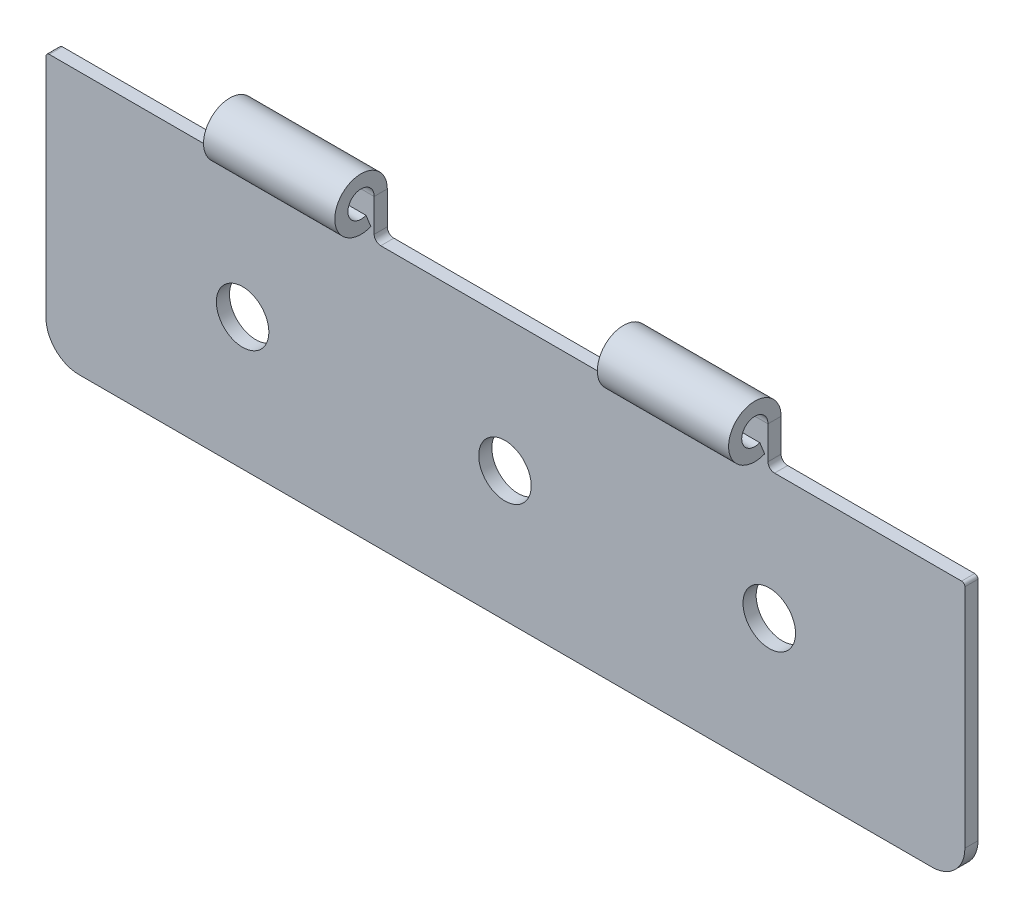
ISO-10303-21;
HEADER;
FILE_DESCRIPTION(('STEP AP214'),'2;1');
FILE_NAME('part.step','',(''),(''),'','','');
FILE_SCHEMA(('AUTOMOTIVE_DESIGN { 1 0 10303 214 1 1 1 1 }'));
ENDSEC;
DATA;
#1=APPLICATION_CONTEXT('core data for automotive mechanical design processes');
#2=APPLICATION_PROTOCOL_DEFINITION('international standard','automotive_design',2000,#1);
#3=PRODUCT_CONTEXT('',#1,'mechanical');
#4=PRODUCT('Part','Part','',(#3));
#5=PRODUCT_RELATED_PRODUCT_CATEGORY('part','',(#4));
#6=PRODUCT_DEFINITION_FORMATION('','',#4);
#7=PRODUCT_DEFINITION_CONTEXT('part definition',#1,'design');
#8=PRODUCT_DEFINITION('design','',#6,#7);
#9=PRODUCT_DEFINITION_SHAPE('','',#8);
#10=(LENGTH_UNIT() NAMED_UNIT(*) SI_UNIT(.MILLI.,.METRE.));
#11=(NAMED_UNIT(*) PLANE_ANGLE_UNIT() SI_UNIT($,.RADIAN.));
#12=(NAMED_UNIT(*) SI_UNIT($,.STERADIAN.) SOLID_ANGLE_UNIT());
#13=UNCERTAINTY_MEASURE_WITH_UNIT(LENGTH_MEASURE(1.E-05),#10,'distance_accuracy_value','');
#14=(GEOMETRIC_REPRESENTATION_CONTEXT(3) GLOBAL_UNCERTAINTY_ASSIGNED_CONTEXT((#13)) GLOBAL_UNIT_ASSIGNED_CONTEXT((#10,
#11,#12)) REPRESENTATION_CONTEXT('',''));
#15=CARTESIAN_POINT('',(0.,0.,0.));
#16=DIRECTION('',(0.,0.,1.));
#17=DIRECTION('',(1.,0.,0.));
#18=AXIS2_PLACEMENT_3D('',#15,#16,#17);
#19=CARTESIAN_POINT('',(90.,40.,-2.));
#20=DIRECTION('',(-1.,0.,0.));
#21=DIRECTION('',(0.,0.,1.));
#22=AXIS2_PLACEMENT_3D('',#19,#20,#21);
#23=PLANE('',#22);
#24=DIRECTION('',(0.,-1.,0.));
#25=VECTOR('',#24,1.);
#26=CARTESIAN_POINT('',(90.,40.,-2.));
#27=LINE('',#26,#25);
#28=CARTESIAN_POINT('',(90.,46.,-2.));
#29=VERTEX_POINT('',#28);
#30=CARTESIAN_POINT('',(90.,41.,-2.));
#31=VERTEX_POINT('',#30);
#32=EDGE_CURVE('E261',#29,#31,#27,.T.);
#33=ORIENTED_EDGE('',*,*,#32,.T.);
#34=DIRECTION('',(0.,0.,1.));
#35=VECTOR('',#34,1.);
#36=CARTESIAN_POINT('',(90.,41.,0.));
#37=LINE('',#36,#35);
#38=CARTESIAN_POINT('',(90.,41.,0.));
#39=VERTEX_POINT('',#38);
#40=EDGE_CURVE('E395',#31,#39,#37,.T.);
#41=ORIENTED_EDGE('',*,*,#40,.T.);
#42=DIRECTION('',(0.,-1.,0.));
#43=VECTOR('',#42,1.);
#44=CARTESIAN_POINT('',(90.,40.,0.));
#45=LINE('',#44,#43);
#46=CARTESIAN_POINT('',(90.,46.,0.));
#47=VERTEX_POINT('',#46);
#48=EDGE_CURVE('E376',#47,#39,#45,.T.);
#49=ORIENTED_EDGE('',*,*,#48,.F.);
#50=DIRECTION('',(0.,0.,-1.));
#51=VECTOR('',#50,1.);
#52=CARTESIAN_POINT('',(90.,46.,0.));
#53=LINE('',#52,#51);
#54=EDGE_CURVE('E273',#47,#29,#53,.T.);
#55=ORIENTED_EDGE('',*,*,#54,.T.);
#56=EDGE_LOOP('',(#33,#41,#49,#55));
#57=FACE_BOUND('',#56,.T.);
#58=ADVANCED_FACE('F42',(#57),#23,.T.);
#59=CARTESIAN_POINT('',(30.,40.,-2.));
#60=DIRECTION('',(-1.,0.,0.));
#61=DIRECTION('',(0.,0.,1.));
#62=AXIS2_PLACEMENT_3D('',#59,#60,#61);
#63=PLANE('',#62);
#64=DIRECTION('',(0.,-1.,0.));
#65=VECTOR('',#64,1.);
#66=CARTESIAN_POINT('',(30.,40.,-2.));
#67=LINE('',#66,#65);
#68=CARTESIAN_POINT('',(30.,46.,-2.));
#69=VERTEX_POINT('',#68);
#70=CARTESIAN_POINT('',(30.,41.,-2.));
#71=VERTEX_POINT('',#70);
#72=EDGE_CURVE('E358',#69,#71,#67,.T.);
#73=ORIENTED_EDGE('',*,*,#72,.T.);
#74=DIRECTION('',(0.,0.,1.));
#75=VECTOR('',#74,1.);
#76=CARTESIAN_POINT('',(30.,41.,0.));
#77=LINE('',#76,#75);
#78=CARTESIAN_POINT('',(30.,41.,0.));
#79=VERTEX_POINT('',#78);
#80=EDGE_CURVE('E366',#71,#79,#77,.T.);
#81=ORIENTED_EDGE('',*,*,#80,.T.);
#82=DIRECTION('',(0.,-1.,0.));
#83=VECTOR('',#82,1.);
#84=CARTESIAN_POINT('',(30.,40.,0.));
#85=LINE('',#84,#83);
#86=CARTESIAN_POINT('',(30.,46.,0.));
#87=VERTEX_POINT('',#86);
#88=EDGE_CURVE('E384',#87,#79,#85,.T.);
#89=ORIENTED_EDGE('',*,*,#88,.F.);
#90=DIRECTION('',(0.,0.,-1.));
#91=VECTOR('',#90,1.);
#92=CARTESIAN_POINT('',(30.,46.,0.));
#93=LINE('',#92,#91);
#94=EDGE_CURVE('E319',#87,#69,#93,.T.);
#95=ORIENTED_EDGE('',*,*,#94,.T.);
#96=EDGE_LOOP('',(#73,#81,#89,#95));
#97=FACE_BOUND('',#96,.T.);
#98=ADVANCED_FACE('F498',(#97),#63,.T.);
#99=CARTESIAN_POINT('',(140.,0.,-2.));
#100=DIRECTION('',(0.,-1.,0.));
#101=DIRECTION('',(1.,0.,0.));
#102=AXIS2_PLACEMENT_3D('',#99,#100,#101);
#103=PLANE('',#102);
#104=DIRECTION('',(1.,0.,0.));
#105=VECTOR('',#104,1.);
#106=CARTESIAN_POINT('',(140.,0.,-2.));
#107=LINE('',#106,#105);
#108=CARTESIAN_POINT('',(5.,0.,-2.));
#109=VERTEX_POINT('',#108);
#110=CARTESIAN_POINT('',(135.,0.,-2.));
#111=VERTEX_POINT('',#110);
#112=EDGE_CURVE('E345',#109,#111,#107,.T.);
#113=ORIENTED_EDGE('',*,*,#112,.T.);
#114=DIRECTION('',(0.,0.,1.));
#115=VECTOR('',#114,1.);
#116=CARTESIAN_POINT('',(135.,0.,-2.));
#117=LINE('',#116,#115);
#118=CARTESIAN_POINT('',(135.,0.,0.));
#119=VERTEX_POINT('',#118);
#120=EDGE_CURVE('E427',#111,#119,#117,.T.);
#121=ORIENTED_EDGE('',*,*,#120,.T.);
#122=DIRECTION('',(1.,0.,0.));
#123=VECTOR('',#122,1.);
#124=CARTESIAN_POINT('',(140.,0.,0.));
#125=LINE('',#124,#123);
#126=CARTESIAN_POINT('',(5.,0.,0.));
#127=VERTEX_POINT('',#126);
#128=EDGE_CURVE('E342',#127,#119,#125,.T.);
#129=ORIENTED_EDGE('',*,*,#128,.F.);
#130=DIRECTION('',(0.,0.,1.));
#131=VECTOR('',#130,1.);
#132=CARTESIAN_POINT('',(5.,0.,-2.));
#133=LINE('',#132,#131);
#134=EDGE_CURVE('E425',#127,#109,#133,.F.);
#135=ORIENTED_EDGE('',*,*,#134,.T.);
#136=EDGE_LOOP('',(#113,#121,#129,#135));
#137=FACE_BOUND('',#136,.T.);
#138=ADVANCED_FACE('F470',(#137),#103,.T.);
#139=CARTESIAN_POINT('',(0.,0.,-2.));
#140=DIRECTION('',(-1.,0.,0.));
#141=DIRECTION('',(0.,0.,1.));
#142=AXIS2_PLACEMENT_3D('',#139,#140,#141);
#143=PLANE('',#142);
#144=DIRECTION('',(0.,-1.,0.));
#145=VECTOR('',#144,1.);
#146=CARTESIAN_POINT('',(0.,0.,0.));
#147=LINE('',#146,#145);
#148=CARTESIAN_POINT('',(0.,39.5,0.));
#149=VERTEX_POINT('',#148);
#150=CARTESIAN_POINT('',(0.,5.,0.));
#151=VERTEX_POINT('',#150);
#152=EDGE_CURVE('E349',#149,#151,#147,.T.);
#153=ORIENTED_EDGE('',*,*,#152,.F.);
#154=DIRECTION('',(0.,0.,1.));
#155=VECTOR('',#154,1.);
#156=CARTESIAN_POINT('',(0.,39.5,-2.));
#157=LINE('',#156,#155);
#158=CARTESIAN_POINT('',(0.,39.5,-2.));
#159=VERTEX_POINT('',#158);
#160=EDGE_CURVE('E451',#149,#159,#157,.F.);
#161=ORIENTED_EDGE('',*,*,#160,.T.);
#162=DIRECTION('',(0.,-1.,0.));
#163=VECTOR('',#162,1.);
#164=CARTESIAN_POINT('',(0.,0.,-2.));
#165=LINE('',#164,#163);
#166=CARTESIAN_POINT('',(0.,5.,-2.));
#167=VERTEX_POINT('',#166);
#168=EDGE_CURVE('E364',#159,#167,#165,.T.);
#169=ORIENTED_EDGE('',*,*,#168,.T.);
#170=DIRECTION('',(0.,0.,1.));
#171=VECTOR('',#170,1.);
#172=CARTESIAN_POINT('',(0.,5.,-2.));
#173=LINE('',#172,#171);
#174=EDGE_CURVE('E441',#167,#151,#173,.T.);
#175=ORIENTED_EDGE('',*,*,#174,.T.);
#176=EDGE_LOOP('',(#153,#161,#169,#175));
#177=FACE_BOUND('',#176,.T.);
#178=ADVANCED_FACE('F480',(#177),#143,.T.);
#179=CARTESIAN_POINT('',(0.,40.,-2.));
#180=DIRECTION('',(0.,1.,0.));
#181=DIRECTION('',(0.,0.,1.));
#182=AXIS2_PLACEMENT_3D('',#179,#180,#181);
#183=PLANE('',#182);
#184=DIRECTION('',(-1.,0.,0.));
#185=VECTOR('',#184,1.);
#186=CARTESIAN_POINT('',(0.,40.,-2.));
#187=LINE('',#186,#185);
#188=CARTESIAN_POINT('',(29.,40.,-2.));
#189=VERTEX_POINT('',#188);
#190=CARTESIAN_POINT('',(0.5,40.,-2.));
#191=VERTEX_POINT('',#190);
#192=EDGE_CURVE('E361',#189,#191,#187,.T.);
#193=ORIENTED_EDGE('',*,*,#192,.T.);
#194=DIRECTION('',(0.,0.,1.));
#195=VECTOR('',#194,1.);
#196=CARTESIAN_POINT('',(0.5,40.,-2.));
#197=LINE('',#196,#195);
#198=CARTESIAN_POINT('',(0.5,40.,0.));
#199=VERTEX_POINT('',#198);
#200=EDGE_CURVE('E444',#191,#199,#197,.T.);
#201=ORIENTED_EDGE('',*,*,#200,.T.);
#202=DIRECTION('',(-1.,0.,0.));
#203=VECTOR('',#202,1.);
#204=CARTESIAN_POINT('',(0.,40.,0.));
#205=LINE('',#204,#203);
#206=CARTESIAN_POINT('',(29.,40.,0.));
#207=VERTEX_POINT('',#206);
#208=EDGE_CURVE('E387',#207,#199,#205,.T.);
#209=ORIENTED_EDGE('',*,*,#208,.F.);
#210=DIRECTION('',(0.,0.,1.));
#211=VECTOR('',#210,1.);
#212=CARTESIAN_POINT('',(29.,40.,-2.));
#213=LINE('',#212,#211);
#214=EDGE_CURVE('E393',#207,#189,#213,.F.);
#215=ORIENTED_EDGE('',*,*,#214,.T.);
#216=EDGE_LOOP('',(#193,#201,#209,#215));
#217=FACE_BOUND('',#216,.T.);
#218=ADVANCED_FACE('F489',(#217),#183,.T.);
#219=CARTESIAN_POINT('',(50.,50.,-2.));
#220=DIRECTION('',(1.,0.,0.));
#221=DIRECTION('',(0.,0.,-1.));
#222=AXIS2_PLACEMENT_3D('',#219,#220,#221);
#223=PLANE('',#222);
#224=DIRECTION('',(0.,1.,0.));
#225=VECTOR('',#224,1.);
#226=CARTESIAN_POINT('',(50.,50.,0.));
#227=LINE('',#226,#225);
#228=CARTESIAN_POINT('',(50.,41.,0.));
#229=VERTEX_POINT('',#228);
#230=CARTESIAN_POINT('',(50.,46.,0.));
#231=VERTEX_POINT('',#230);
#232=EDGE_CURVE('E382',#229,#231,#227,.T.);
#233=ORIENTED_EDGE('',*,*,#232,.F.);
#234=DIRECTION('',(0.,0.,1.));
#235=VECTOR('',#234,1.);
#236=CARTESIAN_POINT('',(50.,41.,-2.));
#237=LINE('',#236,#235);
#238=CARTESIAN_POINT('',(50.,41.,-2.));
#239=VERTEX_POINT('',#238);
#240=EDGE_CURVE('E407',#229,#239,#237,.F.);
#241=ORIENTED_EDGE('',*,*,#240,.T.);
#242=DIRECTION('',(0.,1.,0.));
#243=VECTOR('',#242,1.);
#244=CARTESIAN_POINT('',(50.,50.,-2.));
#245=LINE('',#244,#243);
#246=CARTESIAN_POINT('',(50.,46.,-2.));
#247=VERTEX_POINT('',#246);
#248=EDGE_CURVE('E356',#239,#247,#245,.T.);
#249=ORIENTED_EDGE('',*,*,#248,.T.);
#250=DIRECTION('',(0.,0.,-1.));
#251=VECTOR('',#250,1.);
#252=CARTESIAN_POINT('',(50.,46.,0.));
#253=LINE('',#252,#251);
#254=EDGE_CURVE('E335',#231,#247,#253,.T.);
#255=ORIENTED_EDGE('',*,*,#254,.F.);
#256=EDGE_LOOP('',(#233,#241,#249,#255));
#257=FACE_BOUND('',#256,.T.);
#258=ADVANCED_FACE('F522',(#257),#223,.T.);
#259=CARTESIAN_POINT('',(50.,40.,-2.));
#260=DIRECTION('',(0.,1.,0.));
#261=DIRECTION('',(0.,0.,1.));
#262=AXIS2_PLACEMENT_3D('',#259,#260,#261);
#263=PLANE('',#262);
#264=DIRECTION('',(-1.,0.,0.));
#265=VECTOR('',#264,1.);
#266=CARTESIAN_POINT('',(50.,40.,0.));
#267=LINE('',#266,#265);
#268=CARTESIAN_POINT('',(89.,40.,0.));
#269=VERTEX_POINT('',#268);
#270=CARTESIAN_POINT('',(51.,40.,0.));
#271=VERTEX_POINT('',#270);
#272=EDGE_CURVE('E379',#269,#271,#267,.T.);
#273=ORIENTED_EDGE('',*,*,#272,.F.);
#274=DIRECTION('',(0.,0.,1.));
#275=VECTOR('',#274,1.);
#276=CARTESIAN_POINT('',(89.,40.,-2.));
#277=LINE('',#276,#275);
#278=CARTESIAN_POINT('',(89.,40.,-2.));
#279=VERTEX_POINT('',#278);
#280=EDGE_CURVE('E401',#269,#279,#277,.F.);
#281=ORIENTED_EDGE('',*,*,#280,.T.);
#282=DIRECTION('',(-1.,0.,0.));
#283=VECTOR('',#282,1.);
#284=CARTESIAN_POINT('',(50.,40.,-2.));
#285=LINE('',#284,#283);
#286=CARTESIAN_POINT('',(51.,40.,-2.));
#287=VERTEX_POINT('',#286);
#288=EDGE_CURVE('E353',#279,#287,#285,.T.);
#289=ORIENTED_EDGE('',*,*,#288,.T.);
#290=DIRECTION('',(0.,0.,1.));
#291=VECTOR('',#290,1.);
#292=CARTESIAN_POINT('',(51.,40.,0.));
#293=LINE('',#292,#291);
#294=EDGE_CURVE('E398',#287,#271,#293,.T.);
#295=ORIENTED_EDGE('',*,*,#294,.T.);
#296=EDGE_LOOP('',(#273,#281,#289,#295));
#297=FACE_BOUND('',#296,.T.);
#298=ADVANCED_FACE('F531',(#297),#263,.T.);
#299=CARTESIAN_POINT('',(110.,50.,-2.));
#300=DIRECTION('',(1.,0.,0.));
#301=DIRECTION('',(0.,0.,-1.));
#302=AXIS2_PLACEMENT_3D('',#299,#300,#301);
#303=PLANE('',#302);
#304=DIRECTION('',(0.,1.,0.));
#305=VECTOR('',#304,1.);
#306=CARTESIAN_POINT('',(110.,50.,0.));
#307=LINE('',#306,#305);
#308=CARTESIAN_POINT('',(110.,41.,0.));
#309=VERTEX_POINT('',#308);
#310=CARTESIAN_POINT('',(110.,46.,0.));
#311=VERTEX_POINT('',#310);
#312=EDGE_CURVE('E374',#309,#311,#307,.T.);
#313=ORIENTED_EDGE('',*,*,#312,.F.);
#314=DIRECTION('',(0.,0.,1.));
#315=VECTOR('',#314,1.);
#316=CARTESIAN_POINT('',(110.,41.,-2.));
#317=LINE('',#316,#315);
#318=CARTESIAN_POINT('',(110.,41.,-2.));
#319=VERTEX_POINT('',#318);
#320=EDGE_CURVE('E257',#309,#319,#317,.F.);
#321=ORIENTED_EDGE('',*,*,#320,.T.);
#322=DIRECTION('',(0.,1.,0.));
#323=VECTOR('',#322,1.);
#324=CARTESIAN_POINT('',(110.,50.,-2.));
#325=LINE('',#324,#323);
#326=CARTESIAN_POINT('',(110.,46.,-2.));
#327=VERTEX_POINT('',#326);
#328=EDGE_CURVE('E251',#319,#327,#325,.T.);
#329=ORIENTED_EDGE('',*,*,#328,.T.);
#330=DIRECTION('',(0.,0.,-1.));
#331=VECTOR('',#330,1.);
#332=CARTESIAN_POINT('',(110.,46.,0.));
#333=LINE('',#332,#331);
#334=EDGE_CURVE('E255',#311,#327,#333,.T.);
#335=ORIENTED_EDGE('',*,*,#334,.F.);
#336=EDGE_LOOP('',(#313,#321,#329,#335));
#337=FACE_BOUND('',#336,.T.);
#338=ADVANCED_FACE('F254',(#337),#303,.T.);
#339=CARTESIAN_POINT('',(110.,40.,-2.));
#340=DIRECTION('',(0.,1.,0.));
#341=DIRECTION('',(-1.,0.,0.));
#342=AXIS2_PLACEMENT_3D('',#339,#340,#341);
#343=PLANE('',#342);
#344=DIRECTION('',(-1.,0.,0.));
#345=VECTOR('',#344,1.);
#346=CARTESIAN_POINT('',(110.,40.,0.));
#347=LINE('',#346,#345);
#348=CARTESIAN_POINT('',(139.5,40.,0.));
#349=VERTEX_POINT('',#348);
#350=CARTESIAN_POINT('',(111.,40.,0.));
#351=VERTEX_POINT('',#350);
#352=EDGE_CURVE('E372',#349,#351,#347,.T.);
#353=ORIENTED_EDGE('',*,*,#352,.F.);
#354=DIRECTION('',(0.,0.,1.));
#355=VECTOR('',#354,1.);
#356=CARTESIAN_POINT('',(139.5,40.,-2.));
#357=LINE('',#356,#355);
#358=CARTESIAN_POINT('',(139.5,40.,-2.));
#359=VERTEX_POINT('',#358);
#360=EDGE_CURVE('E11',#349,#359,#357,.F.);
#361=ORIENTED_EDGE('',*,*,#360,.T.);
#362=DIRECTION('',(-1.,0.,0.));
#363=VECTOR('',#362,1.);
#364=CARTESIAN_POINT('',(110.,40.,-2.));
#365=LINE('',#364,#363);
#366=CARTESIAN_POINT('',(111.,40.,-2.));
#367=VERTEX_POINT('',#366);
#368=EDGE_CURVE('E262',#359,#367,#365,.T.);
#369=ORIENTED_EDGE('',*,*,#368,.T.);
#370=DIRECTION('',(0.,0.,1.));
#371=VECTOR('',#370,1.);
#372=CARTESIAN_POINT('',(111.,40.,0.));
#373=LINE('',#372,#371);
#374=EDGE_CURVE('E403',#367,#351,#373,.T.);
#375=ORIENTED_EDGE('',*,*,#374,.T.);
#376=EDGE_LOOP('',(#353,#361,#369,#375));
#377=FACE_BOUND('',#376,.T.);
#378=ADVANCED_FACE('F569',(#377),#343,.T.);
#379=CARTESIAN_POINT('',(140.,40.,-2.));
#380=DIRECTION('',(1.,0.,0.));
#381=DIRECTION('',(0.,0.,-1.));
#382=AXIS2_PLACEMENT_3D('',#379,#380,#381);
#383=PLANE('',#382);
#384=DIRECTION('',(0.,1.,0.));
#385=VECTOR('',#384,1.);
#386=CARTESIAN_POINT('',(140.,40.,-2.));
#387=LINE('',#386,#385);
#388=CARTESIAN_POINT('',(140.,5.,-2.));
#389=VERTEX_POINT('',#388);
#390=CARTESIAN_POINT('',(140.,39.5,-2.));
#391=VERTEX_POINT('',#390);
#392=EDGE_CURVE('E348',#389,#391,#387,.T.);
#393=ORIENTED_EDGE('',*,*,#392,.T.);
#394=DIRECTION('',(0.,0.,1.));
#395=VECTOR('',#394,1.);
#396=CARTESIAN_POINT('',(140.,39.5,-2.));
#397=LINE('',#396,#395);
#398=CARTESIAN_POINT('',(140.,39.5,0.));
#399=VERTEX_POINT('',#398);
#400=EDGE_CURVE('E50',#391,#399,#397,.T.);
#401=ORIENTED_EDGE('',*,*,#400,.T.);
#402=DIRECTION('',(0.,1.,0.));
#403=VECTOR('',#402,1.);
#404=CARTESIAN_POINT('',(140.,40.,0.));
#405=LINE('',#404,#403);
#406=CARTESIAN_POINT('',(140.,5.,0.));
#407=VERTEX_POINT('',#406);
#408=EDGE_CURVE('E369',#407,#399,#405,.T.);
#409=ORIENTED_EDGE('',*,*,#408,.F.);
#410=DIRECTION('',(0.,0.,1.));
#411=VECTOR('',#410,1.);
#412=CARTESIAN_POINT('',(140.,5.,-2.));
#413=LINE('',#412,#411);
#414=EDGE_CURVE('E434',#407,#389,#413,.F.);
#415=ORIENTED_EDGE('',*,*,#414,.T.);
#416=EDGE_LOOP('',(#393,#401,#409,#415));
#417=FACE_BOUND('',#416,.T.);
#418=ADVANCED_FACE('F459',(#417),#383,.T.);
#419=CARTESIAN_POINT('',(0.,0.,-2.));
#420=DIRECTION('',(0.,0.,-1.));
#421=DIRECTION('',(-1.,0.,0.));
#422=AXIS2_PLACEMENT_3D('',#419,#420,#421);
#423=PLANE('',#422);
#424=CARTESIAN_POINT('',(110.196351758418,20.448547007561,-2.));
#425=DIRECTION('',(0.,0.,-1.));
#426=DIRECTION('',(-1.,0.,0.));
#427=AXIS2_PLACEMENT_3D('',#424,#425,#426);
#428=CIRCLE('',#427,4.);
#429=CARTESIAN_POINT('',(106.196351758418,20.448547007561,-2.));
#430=VERTEX_POINT('',#429);
#431=EDGE_CURVE('E894',#430,#430,#428,.T.);
#432=ORIENTED_EDGE('',*,*,#431,.F.);
#433=EDGE_LOOP('',(#432));
#434=FACE_BOUND('',#433,.T.);
#435=CARTESIAN_POINT('',(69.9286133472583,19.7779854141231,-2.));
#436=DIRECTION('',(0.,0.,-1.));
#437=DIRECTION('',(-1.,0.,0.));
#438=AXIS2_PLACEMENT_3D('',#435,#436,#437);
#439=CIRCLE('',#438,4.);
#440=CARTESIAN_POINT('',(65.9286133472583,19.7779854141231,-2.));
#441=VERTEX_POINT('',#440);
#442=EDGE_CURVE('E888',#441,#441,#439,.T.);
#443=ORIENTED_EDGE('',*,*,#442,.F.);
#444=EDGE_LOOP('',(#443));
#445=FACE_BOUND('',#444,.T.);
#446=CARTESIAN_POINT('',(29.9557500667113,20.0771289072838,-2.));
#447=DIRECTION('',(0.,0.,1.));
#448=DIRECTION('',(1.,0.,0.));
#449=AXIS2_PLACEMENT_3D('',#446,#447,#448);
#450=CIRCLE('',#449,4.00000000000001);
#451=CARTESIAN_POINT('',(33.9557500667113,20.0771289072838,-2.));
#452=VERTEX_POINT('',#451);
#453=EDGE_CURVE('E304',#452,#452,#450,.T.);
#454=ORIENTED_EDGE('',*,*,#453,.T.);
#455=EDGE_LOOP('',(#454));
#456=FACE_BOUND('',#455,.T.);
#457=ORIENTED_EDGE('',*,*,#168,.F.);
#458=CARTESIAN_POINT('',(0.5,39.5,-2.));
#459=DIRECTION('',(0.,0.,-1.));
#460=DIRECTION('',(-1.,0.,0.));
#461=AXIS2_PLACEMENT_3D('',#458,#459,#460);
#462=CIRCLE('',#461,0.5);
#463=EDGE_CURVE('E454',#159,#191,#462,.T.);
#464=ORIENTED_EDGE('',*,*,#463,.T.);
#465=ORIENTED_EDGE('',*,*,#192,.F.);
#466=CARTESIAN_POINT('',(29.,41.,-2.));
#467=DIRECTION('',(0.,0.,-1.));
#468=DIRECTION('',(-1.,0.,0.));
#469=AXIS2_PLACEMENT_3D('',#466,#467,#468);
#470=CIRCLE('',#469,1.);
#471=EDGE_CURVE('E411',#189,#71,#470,.F.);
#472=ORIENTED_EDGE('',*,*,#471,.T.);
#473=ORIENTED_EDGE('',*,*,#72,.F.);
#474=DIRECTION('',(-1.,0.,0.));
#475=VECTOR('',#474,1.);
#476=CARTESIAN_POINT('',(30.,46.,-2.));
#477=LINE('',#476,#475);
#478=EDGE_CURVE('E312',#69,#247,#477,.F.);
#479=ORIENTED_EDGE('',*,*,#478,.T.);
#480=ORIENTED_EDGE('',*,*,#248,.F.);
#481=CARTESIAN_POINT('',(51.,41.,-2.));
#482=DIRECTION('',(0.,0.,-1.));
#483=DIRECTION('',(-1.,0.,0.));
#484=AXIS2_PLACEMENT_3D('',#481,#482,#483);
#485=CIRCLE('',#484,1.);
#486=EDGE_CURVE('E423',#239,#287,#485,.F.);
#487=ORIENTED_EDGE('',*,*,#486,.T.);
#488=ORIENTED_EDGE('',*,*,#288,.F.);
#489=CARTESIAN_POINT('',(89.,41.,-2.));
#490=DIRECTION('',(0.,0.,-1.));
#491=DIRECTION('',(-1.,0.,0.));
#492=AXIS2_PLACEMENT_3D('',#489,#490,#491);
#493=CIRCLE('',#492,1.);
#494=EDGE_CURVE('E415',#279,#31,#493,.F.);
#495=ORIENTED_EDGE('',*,*,#494,.T.);
#496=ORIENTED_EDGE('',*,*,#32,.F.);
#497=DIRECTION('',(-1.,0.,0.));
#498=VECTOR('',#497,1.);
#499=CARTESIAN_POINT('',(90.,46.,-2.));
#500=LINE('',#499,#498);
#501=EDGE_CURVE('E279',#29,#327,#500,.F.);
#502=ORIENTED_EDGE('',*,*,#501,.T.);
#503=ORIENTED_EDGE('',*,*,#328,.F.);
#504=CARTESIAN_POINT('',(111.,41.,-2.));
#505=DIRECTION('',(0.,0.,-1.));
#506=DIRECTION('',(-1.,0.,0.));
#507=AXIS2_PLACEMENT_3D('',#504,#505,#506);
#508=CIRCLE('',#507,1.);
#509=EDGE_CURVE('E419',#319,#367,#508,.F.);
#510=ORIENTED_EDGE('',*,*,#509,.T.);
#511=ORIENTED_EDGE('',*,*,#368,.F.);
#512=CARTESIAN_POINT('',(139.5,39.5,-2.));
#513=DIRECTION('',(0.,0.,-1.));
#514=DIRECTION('',(-1.,0.,0.));
#515=AXIS2_PLACEMENT_3D('',#512,#513,#514);
#516=CIRCLE('',#515,0.5);
#517=EDGE_CURVE('E66',#359,#391,#516,.T.);
#518=ORIENTED_EDGE('',*,*,#517,.T.);
#519=ORIENTED_EDGE('',*,*,#392,.F.);
#520=CARTESIAN_POINT('',(135.,5.,-2.));
#521=DIRECTION('',(0.,0.,-1.));
#522=DIRECTION('',(-1.,0.,0.));
#523=AXIS2_PLACEMENT_3D('',#520,#521,#522);
#524=CIRCLE('',#523,5.);
#525=EDGE_CURVE('E439',#389,#111,#524,.T.);
#526=ORIENTED_EDGE('',*,*,#525,.T.);
#527=ORIENTED_EDGE('',*,*,#112,.F.);
#528=CARTESIAN_POINT('',(5.,5.,-2.));
#529=DIRECTION('',(0.,0.,-1.));
#530=DIRECTION('',(-1.,0.,0.));
#531=AXIS2_PLACEMENT_3D('',#528,#529,#530);
#532=CIRCLE('',#531,5.);
#533=EDGE_CURVE('E436',#109,#167,#532,.T.);
#534=ORIENTED_EDGE('',*,*,#533,.T.);
#535=EDGE_LOOP('',(#457,#464,#465,#472,#473,#479,#480,#487,#488,#495,#496,#502,#503,#510,#511,
#518,#519,#526,#527,#534));
#536=FACE_BOUND('',#535,.T.);
#537=ADVANCED_FACE('F286',(#434,#445,#456,#536),#423,.T.);
#538=CARTESIAN_POINT('',(0.,0.,0.));
#539=DIRECTION('',(0.,0.,-1.));
#540=DIRECTION('',(-1.,0.,0.));
#541=AXIS2_PLACEMENT_3D('',#538,#539,#540);
#542=PLANE('',#541);
#543=CARTESIAN_POINT('',(110.196351758418,20.448547007561,0.));
#544=DIRECTION('',(0.,0.,1.));
#545=DIRECTION('',(1.,0.,0.));
#546=AXIS2_PLACEMENT_3D('',#543,#544,#545);
#547=CIRCLE('',#546,4.);
#548=CARTESIAN_POINT('',(114.196351758418,20.448547007561,0.));
#549=VERTEX_POINT('',#548);
#550=EDGE_CURVE('E899',#549,#549,#547,.T.);
#551=ORIENTED_EDGE('',*,*,#550,.F.);
#552=EDGE_LOOP('',(#551));
#553=FACE_BOUND('',#552,.T.);
#554=CARTESIAN_POINT('',(69.9286133472583,19.7779854141231,0.));
#555=DIRECTION('',(0.,0.,1.));
#556=DIRECTION('',(1.,0.,0.));
#557=AXIS2_PLACEMENT_3D('',#554,#555,#556);
#558=CIRCLE('',#557,4.);
#559=CARTESIAN_POINT('',(73.9286133472583,19.7779854141231,0.));
#560=VERTEX_POINT('',#559);
#561=EDGE_CURVE('E890',#560,#560,#558,.T.);
#562=ORIENTED_EDGE('',*,*,#561,.F.);
#563=EDGE_LOOP('',(#562));
#564=FACE_BOUND('',#563,.T.);
#565=CARTESIAN_POINT('',(29.9557500667113,20.0771289072838,0.));
#566=DIRECTION('',(0.,0.,1.));
#567=DIRECTION('',(1.,0.,0.));
#568=AXIS2_PLACEMENT_3D('',#565,#566,#567);
#569=CIRCLE('',#568,4.00000000000001);
#570=CARTESIAN_POINT('',(33.9557500667113,20.0771289072838,0.));
#571=VERTEX_POINT('',#570);
#572=EDGE_CURVE('E292',#571,#571,#569,.T.);
#573=ORIENTED_EDGE('',*,*,#572,.F.);
#574=EDGE_LOOP('',(#573));
#575=FACE_BOUND('',#574,.T.);
#576=ORIENTED_EDGE('',*,*,#208,.T.);
#577=CARTESIAN_POINT('',(0.5,39.5,0.));
#578=DIRECTION('',(0.,0.,-1.));
#579=DIRECTION('',(-1.,0.,0.));
#580=AXIS2_PLACEMENT_3D('',#577,#578,#579);
#581=CIRCLE('',#580,0.5);
#582=EDGE_CURVE('E449',#199,#149,#581,.F.);
#583=ORIENTED_EDGE('',*,*,#582,.T.);
#584=ORIENTED_EDGE('',*,*,#152,.T.);
#585=CARTESIAN_POINT('',(5.,5.,0.));
#586=DIRECTION('',(0.,0.,-1.));
#587=DIRECTION('',(-1.,0.,0.));
#588=AXIS2_PLACEMENT_3D('',#585,#586,#587);
#589=CIRCLE('',#588,5.);
#590=EDGE_CURVE('E430',#151,#127,#589,.F.);
#591=ORIENTED_EDGE('',*,*,#590,.T.);
#592=ORIENTED_EDGE('',*,*,#128,.T.);
#593=CARTESIAN_POINT('',(135.,5.,0.));
#594=DIRECTION('',(0.,0.,-1.));
#595=DIRECTION('',(-1.,0.,0.));
#596=AXIS2_PLACEMENT_3D('',#593,#594,#595);
#597=CIRCLE('',#596,5.);
#598=EDGE_CURVE('E432',#119,#407,#597,.F.);
#599=ORIENTED_EDGE('',*,*,#598,.T.);
#600=ORIENTED_EDGE('',*,*,#408,.T.);
#601=CARTESIAN_POINT('',(139.5,39.5,0.));
#602=DIRECTION('',(0.,0.,-1.));
#603=DIRECTION('',(-1.,0.,0.));
#604=AXIS2_PLACEMENT_3D('',#601,#602,#603);
#605=CIRCLE('',#604,0.5);
#606=EDGE_CURVE('E447',#399,#349,#605,.F.);
#607=ORIENTED_EDGE('',*,*,#606,.T.);
#608=ORIENTED_EDGE('',*,*,#352,.T.);
#609=CARTESIAN_POINT('',(111.,41.,0.));
#610=DIRECTION('',(0.,0.,-1.));
#611=DIRECTION('',(-1.,0.,0.));
#612=AXIS2_PLACEMENT_3D('',#609,#610,#611);
#613=CIRCLE('',#612,1.);
#614=EDGE_CURVE('E417',#351,#309,#613,.T.);
#615=ORIENTED_EDGE('',*,*,#614,.T.);
#616=ORIENTED_EDGE('',*,*,#312,.T.);
#617=DIRECTION('',(-1.,0.,0.));
#618=VECTOR('',#617,1.);
#619=CARTESIAN_POINT('',(90.,46.,0.));
#620=LINE('',#619,#618);
#621=EDGE_CURVE('E297',#47,#311,#620,.F.);
#622=ORIENTED_EDGE('',*,*,#621,.F.);
#623=ORIENTED_EDGE('',*,*,#48,.T.);
#624=CARTESIAN_POINT('',(89.,41.,0.));
#625=DIRECTION('',(0.,0.,-1.));
#626=DIRECTION('',(-1.,0.,0.));
#627=AXIS2_PLACEMENT_3D('',#624,#625,#626);
#628=CIRCLE('',#627,1.);
#629=EDGE_CURVE('E413',#39,#269,#628,.T.);
#630=ORIENTED_EDGE('',*,*,#629,.T.);
#631=ORIENTED_EDGE('',*,*,#272,.T.);
#632=CARTESIAN_POINT('',(51.,41.,0.));
#633=DIRECTION('',(0.,0.,-1.));
#634=DIRECTION('',(-1.,0.,0.));
#635=AXIS2_PLACEMENT_3D('',#632,#633,#634);
#636=CIRCLE('',#635,1.);
#637=EDGE_CURVE('E421',#271,#229,#636,.T.);
#638=ORIENTED_EDGE('',*,*,#637,.T.);
#639=ORIENTED_EDGE('',*,*,#232,.T.);
#640=DIRECTION('',(-1.,0.,0.));
#641=VECTOR('',#640,1.);
#642=CARTESIAN_POINT('',(30.,46.,0.));
#643=LINE('',#642,#641);
#644=EDGE_CURVE('E328',#87,#231,#643,.F.);
#645=ORIENTED_EDGE('',*,*,#644,.F.);
#646=ORIENTED_EDGE('',*,*,#88,.T.);
#647=CARTESIAN_POINT('',(29.,41.,0.));
#648=DIRECTION('',(0.,0.,-1.));
#649=DIRECTION('',(-1.,0.,0.));
#650=AXIS2_PLACEMENT_3D('',#647,#648,#649);
#651=CIRCLE('',#650,1.);
#652=EDGE_CURVE('E409',#79,#207,#651,.T.);
#653=ORIENTED_EDGE('',*,*,#652,.T.);
#654=EDGE_LOOP('',(#576,#583,#584,#591,#592,#599,#600,#607,#608,#615,#616,#622,#623,#630,#631,
#638,#639,#645,#646,#653));
#655=FACE_BOUND('',#654,.T.);
#656=ADVANCED_FACE('F463',(#553,#564,#575,#655),#542,.F.);
#657=CARTESIAN_POINT('',(40.,44.1456322908664,1.25078681316816));
#658=DIRECTION('',(0.,-0.374606593415919,0.927183854566785));
#659=DIRECTION('',(-1.,0.,0.));
#660=AXIS2_PLACEMENT_3D('',#657,#658,#659);
#661=PLANE('',#660);
#662=DIRECTION('',(0.,-0.927183854566785,-0.374606593415919));
#663=VECTOR('',#662,1.);
#664=CARTESIAN_POINT('',(30.,44.1456322908664,1.25078681316816));
#665=LINE('',#664,#663);
#666=CARTESIAN_POINT('',(30.,44.1456322908664,1.25078681316816));
#667=VERTEX_POINT('',#666);
#668=CARTESIAN_POINT('',(30.,42.2912645817329,0.501573626336322));
#669=VERTEX_POINT('',#668);
#670=EDGE_CURVE('E340',#667,#669,#665,.T.);
#671=ORIENTED_EDGE('',*,*,#670,.F.);
#672=DIRECTION('',(-1.,0.,0.));
#673=VECTOR('',#672,1.);
#674=CARTESIAN_POINT('',(30.,44.1456322908664,1.25078681316816));
#675=LINE('',#674,#673);
#676=CARTESIAN_POINT('',(50.,44.1456322908664,1.25078681316816));
#677=VERTEX_POINT('',#676);
#678=EDGE_CURVE('E309',#677,#667,#675,.T.);
#679=ORIENTED_EDGE('',*,*,#678,.F.);
#680=DIRECTION('',(0.,-0.927183854566785,-0.374606593415919));
#681=VECTOR('',#680,1.);
#682=CARTESIAN_POINT('',(50.,44.1456322908664,1.25078681316816));
#683=LINE('',#682,#681);
#684=CARTESIAN_POINT('',(50.,42.2912645817329,0.501573626336322));
#685=VERTEX_POINT('',#684);
#686=EDGE_CURVE('E338',#677,#685,#683,.T.);
#687=ORIENTED_EDGE('',*,*,#686,.T.);
#688=DIRECTION('',(-1.,0.,0.));
#689=VECTOR('',#688,1.);
#690=CARTESIAN_POINT('',(30.,42.2912645817329,0.501573626336322));
#691=LINE('',#690,#689);
#692=EDGE_CURVE('E320',#685,#669,#691,.T.);
#693=ORIENTED_EDGE('',*,*,#692,.T.);
#694=EDGE_LOOP('',(#671,#679,#687,#693));
#695=FACE_BOUND('',#694,.T.);
#696=ADVANCED_FACE('F513',(#695),#661,.F.);
#697=CARTESIAN_POINT('',(50.,46.,2.));
#698=DIRECTION('',(1.,0.,0.));
#699=DIRECTION('',(0.,0.,-1.));
#700=AXIS2_PLACEMENT_3D('',#697,#698,#699);
#701=PLANE('',#700);
#702=ORIENTED_EDGE('',*,*,#686,.F.);
#703=CARTESIAN_POINT('',(50.,46.,2.));
#704=DIRECTION('',(-1.,0.,0.));
#705=DIRECTION('',(0.,0.,1.));
#706=AXIS2_PLACEMENT_3D('',#703,#704,#705);
#707=CIRCLE('',#706,2.00000000000001);
#708=EDGE_CURVE('E323',#231,#677,#707,.F.);
#709=ORIENTED_EDGE('',*,*,#708,.F.);
#710=ORIENTED_EDGE('',*,*,#254,.T.);
#711=CARTESIAN_POINT('',(50.,46.,2.));
#712=DIRECTION('',(-1.,0.,0.));
#713=DIRECTION('',(0.,0.,1.));
#714=AXIS2_PLACEMENT_3D('',#711,#712,#713);
#715=CIRCLE('',#714,4.00000000000001);
#716=EDGE_CURVE('E315',#247,#685,#715,.F.);
#717=ORIENTED_EDGE('',*,*,#716,.T.);
#718=EDGE_LOOP('',(#702,#709,#710,#717));
#719=FACE_BOUND('',#718,.T.);
#720=ADVANCED_FACE('F519',(#719),#701,.T.);
#721=CARTESIAN_POINT('',(30.,46.,2.));
#722=DIRECTION('',(1.,0.,0.));
#723=DIRECTION('',(0.,0.,-1.));
#724=AXIS2_PLACEMENT_3D('',#721,#722,#723);
#725=PLANE('',#724);
#726=CARTESIAN_POINT('',(30.,46.,2.));
#727=DIRECTION('',(-1.,0.,0.));
#728=DIRECTION('',(0.,0.,1.));
#729=AXIS2_PLACEMENT_3D('',#726,#727,#728);
#730=CIRCLE('',#729,2.00000000000001);
#731=EDGE_CURVE('E331',#667,#87,#730,.T.);
#732=ORIENTED_EDGE('',*,*,#731,.F.);
#733=ORIENTED_EDGE('',*,*,#670,.T.);
#734=CARTESIAN_POINT('',(30.,46.,2.));
#735=DIRECTION('',(-1.,0.,0.));
#736=DIRECTION('',(0.,0.,1.));
#737=AXIS2_PLACEMENT_3D('',#734,#735,#736);
#738=CIRCLE('',#737,4.00000000000001);
#739=EDGE_CURVE('E316',#669,#69,#738,.T.);
#740=ORIENTED_EDGE('',*,*,#739,.T.);
#741=ORIENTED_EDGE('',*,*,#94,.F.);
#742=EDGE_LOOP('',(#732,#733,#740,#741));
#743=FACE_BOUND('',#742,.T.);
#744=ADVANCED_FACE('F510',(#743),#725,.F.);
#745=CARTESIAN_POINT('',(30.,46.,2.));
#746=DIRECTION('',(-1.,0.,0.));
#747=DIRECTION('',(0.,-0.927183854566784,-0.374606593415919));
#748=AXIS2_PLACEMENT_3D('',#745,#746,#747);
#749=CYLINDRICAL_SURFACE('',#748,4.00000000000001);
#750=ORIENTED_EDGE('',*,*,#478,.F.);
#751=ORIENTED_EDGE('',*,*,#739,.F.);
#752=ORIENTED_EDGE('',*,*,#692,.F.);
#753=ORIENTED_EDGE('',*,*,#716,.F.);
#754=EDGE_LOOP('',(#750,#751,#752,#753));
#755=FACE_BOUND('',#754,.T.);
#756=ADVANCED_FACE('F506',(#755),#749,.T.);
#757=CARTESIAN_POINT('',(30.,46.,2.));
#758=DIRECTION('',(-1.,0.,0.));
#759=DIRECTION('',(0.,-0.927183854566784,-0.374606593415919));
#760=AXIS2_PLACEMENT_3D('',#757,#758,#759);
#761=CYLINDRICAL_SURFACE('',#760,2.00000000000001);
#762=ORIENTED_EDGE('',*,*,#644,.T.);
#763=ORIENTED_EDGE('',*,*,#708,.T.);
#764=ORIENTED_EDGE('',*,*,#678,.T.);
#765=ORIENTED_EDGE('',*,*,#731,.T.);
#766=EDGE_LOOP('',(#762,#763,#764,#765));
#767=FACE_BOUND('',#766,.T.);
#768=ADVANCED_FACE('F515',(#767),#761,.F.);
#769=CARTESIAN_POINT('',(100.,44.1456322908664,1.25078681316816));
#770=DIRECTION('',(0.,-0.374606593415919,0.927183854566784));
#771=DIRECTION('',(-1.,0.,0.));
#772=AXIS2_PLACEMENT_3D('',#769,#770,#771);
#773=PLANE('',#772);
#774=DIRECTION('',(0.,-0.927183854566784,-0.374606593415919));
#775=VECTOR('',#774,1.);
#776=CARTESIAN_POINT('',(90.,44.1456322908664,1.25078681316816));
#777=LINE('',#776,#775);
#778=CARTESIAN_POINT('',(90.,44.1456322908664,1.25078681316816));
#779=VERTEX_POINT('',#778);
#780=CARTESIAN_POINT('',(90.,42.2912645817329,0.501573626336322));
#781=VERTEX_POINT('',#780);
#782=EDGE_CURVE('E307',#779,#781,#777,.T.);
#783=ORIENTED_EDGE('',*,*,#782,.F.);
#784=DIRECTION('',(-1.,0.,0.));
#785=VECTOR('',#784,1.);
#786=CARTESIAN_POINT('',(90.,44.1456322908664,1.25078681316816));
#787=LINE('',#786,#785);
#788=CARTESIAN_POINT('',(110.,44.1456322908664,1.25078681316816));
#789=VERTEX_POINT('',#788);
#790=EDGE_CURVE('E302',#789,#779,#787,.T.);
#791=ORIENTED_EDGE('',*,*,#790,.F.);
#792=DIRECTION('',(0.,-0.927183854566784,-0.374606593415919));
#793=VECTOR('',#792,1.);
#794=CARTESIAN_POINT('',(110.,44.1456322908664,1.25078681316816));
#795=LINE('',#794,#793);
#796=CARTESIAN_POINT('',(110.,42.2912645817329,0.501573626336322));
#797=VERTEX_POINT('',#796);
#798=EDGE_CURVE('E272',#789,#797,#795,.T.);
#799=ORIENTED_EDGE('',*,*,#798,.T.);
#800=DIRECTION('',(-1.,0.,0.));
#801=VECTOR('',#800,1.);
#802=CARTESIAN_POINT('',(90.,42.2912645817329,0.501573626336322));
#803=LINE('',#802,#801);
#804=EDGE_CURVE('E282',#797,#781,#803,.T.);
#805=ORIENTED_EDGE('',*,*,#804,.T.);
#806=EDGE_LOOP('',(#783,#791,#799,#805));
#807=FACE_BOUND('',#806,.T.);
#808=ADVANCED_FACE('F547',(#807),#773,.F.);
#809=CARTESIAN_POINT('',(110.,46.,2.));
#810=DIRECTION('',(1.,0.,0.));
#811=DIRECTION('',(0.,0.,-1.));
#812=AXIS2_PLACEMENT_3D('',#809,#810,#811);
#813=PLANE('',#812);
#814=ORIENTED_EDGE('',*,*,#798,.F.);
#815=CARTESIAN_POINT('',(110.,46.,2.));
#816=DIRECTION('',(-1.,0.,0.));
#817=DIRECTION('',(0.,0.,1.));
#818=AXIS2_PLACEMENT_3D('',#815,#816,#817);
#819=CIRCLE('',#818,2.);
#820=EDGE_CURVE('E271',#311,#789,#819,.F.);
#821=ORIENTED_EDGE('',*,*,#820,.F.);
#822=ORIENTED_EDGE('',*,*,#334,.T.);
#823=CARTESIAN_POINT('',(110.,46.,2.));
#824=DIRECTION('',(-1.,0.,0.));
#825=DIRECTION('',(0.,0.,1.));
#826=AXIS2_PLACEMENT_3D('',#823,#824,#825);
#827=CIRCLE('',#826,4.);
#828=EDGE_CURVE('E269',#327,#797,#827,.F.);
#829=ORIENTED_EDGE('',*,*,#828,.T.);
#830=EDGE_LOOP('',(#814,#821,#822,#829));
#831=FACE_BOUND('',#830,.T.);
#832=ADVANCED_FACE('F268',(#831),#813,.T.);
#833=CARTESIAN_POINT('',(90.,46.,2.));
#834=DIRECTION('',(1.,0.,0.));
#835=DIRECTION('',(0.,0.,-1.));
#836=AXIS2_PLACEMENT_3D('',#833,#834,#835);
#837=PLANE('',#836);
#838=CARTESIAN_POINT('',(90.,46.,2.));
#839=DIRECTION('',(-1.,0.,0.));
#840=DIRECTION('',(0.,0.,1.));
#841=AXIS2_PLACEMENT_3D('',#838,#839,#840);
#842=CIRCLE('',#841,2.);
#843=EDGE_CURVE('E300',#779,#47,#842,.T.);
#844=ORIENTED_EDGE('',*,*,#843,.F.);
#845=ORIENTED_EDGE('',*,*,#782,.T.);
#846=CARTESIAN_POINT('',(90.,46.,2.));
#847=DIRECTION('',(-1.,0.,0.));
#848=DIRECTION('',(0.,0.,1.));
#849=AXIS2_PLACEMENT_3D('',#846,#847,#848);
#850=CIRCLE('',#849,4.);
#851=EDGE_CURVE('E288',#781,#29,#850,.T.);
#852=ORIENTED_EDGE('',*,*,#851,.T.);
#853=ORIENTED_EDGE('',*,*,#54,.F.);
#854=EDGE_LOOP('',(#844,#845,#852,#853));
#855=FACE_BOUND('',#854,.T.);
#856=ADVANCED_FACE('F542',(#855),#837,.F.);
#857=CARTESIAN_POINT('',(90.,46.,2.));
#858=DIRECTION('',(-1.,0.,0.));
#859=DIRECTION('',(0.,-0.927183854566784,-0.374606593415919));
#860=AXIS2_PLACEMENT_3D('',#857,#858,#859);
#861=CYLINDRICAL_SURFACE('',#860,4.);
#862=ORIENTED_EDGE('',*,*,#501,.F.);
#863=ORIENTED_EDGE('',*,*,#851,.F.);
#864=ORIENTED_EDGE('',*,*,#804,.F.);
#865=ORIENTED_EDGE('',*,*,#828,.F.);
#866=EDGE_LOOP('',(#862,#863,#864,#865));
#867=FACE_BOUND('',#866,.T.);
#868=ADVANCED_FACE('F277',(#867),#861,.T.);
#869=CARTESIAN_POINT('',(90.,46.,2.));
#870=DIRECTION('',(-1.,0.,0.));
#871=DIRECTION('',(0.,-0.927183854566784,-0.374606593415919));
#872=AXIS2_PLACEMENT_3D('',#869,#870,#871);
#873=CYLINDRICAL_SURFACE('',#872,2.);
#874=ORIENTED_EDGE('',*,*,#621,.T.);
#875=ORIENTED_EDGE('',*,*,#820,.T.);
#876=ORIENTED_EDGE('',*,*,#790,.T.);
#877=ORIENTED_EDGE('',*,*,#843,.T.);
#878=EDGE_LOOP('',(#874,#875,#876,#877));
#879=FACE_BOUND('',#878,.T.);
#880=ADVANCED_FACE('F544',(#879),#873,.F.);
#881=CARTESIAN_POINT('',(29.9557500667113,20.0771289072838,-2.));
#882=DIRECTION('',(0.,0.,1.));
#883=DIRECTION('',(1.,0.,0.));
#884=AXIS2_PLACEMENT_3D('',#881,#882,#883);
#885=CYLINDRICAL_SURFACE('',#884,4.00000000000001);
#886=ORIENTED_EDGE('',*,*,#453,.F.);
#887=EDGE_LOOP('',(#886));
#888=FACE_BOUND('',#887,.T.);
#889=ORIENTED_EDGE('',*,*,#572,.T.);
#890=EDGE_LOOP('',(#889));
#891=FACE_BOUND('',#890,.T.);
#892=ADVANCED_FACE('F769',(#888,#891),#885,.F.);
#893=CARTESIAN_POINT('',(69.9286133472583,19.7779854141231,-8.));
#894=DIRECTION('',(0.,0.,1.));
#895=DIRECTION('',(1.,0.,0.));
#896=AXIS2_PLACEMENT_3D('',#893,#894,#895);
#897=CYLINDRICAL_SURFACE('',#896,4.);
#898=ORIENTED_EDGE('',*,*,#442,.T.);
#899=EDGE_LOOP('',(#898));
#900=FACE_BOUND('',#899,.T.);
#901=ORIENTED_EDGE('',*,*,#561,.T.);
#902=EDGE_LOOP('',(#901));
#903=FACE_BOUND('',#902,.T.);
#904=ADVANCED_FACE('F759',(#900,#903),#897,.F.);
#905=CARTESIAN_POINT('',(110.196351758418,20.448547007561,-8.));
#906=DIRECTION('',(0.,0.,1.));
#907=DIRECTION('',(1.,0.,0.));
#908=AXIS2_PLACEMENT_3D('',#905,#906,#907);
#909=CYLINDRICAL_SURFACE('',#908,4.);
#910=ORIENTED_EDGE('',*,*,#431,.T.);
#911=EDGE_LOOP('',(#910));
#912=FACE_BOUND('',#911,.T.);
#913=ORIENTED_EDGE('',*,*,#550,.T.);
#914=EDGE_LOOP('',(#913));
#915=FACE_BOUND('',#914,.T.);
#916=ADVANCED_FACE('F578',(#912,#915),#909,.F.);
#917=CARTESIAN_POINT('',(29.,41.,-2.));
#918=DIRECTION('',(0.,0.,-1.));
#919=DIRECTION('',(-1.,0.,0.));
#920=AXIS2_PLACEMENT_3D('',#917,#918,#919);
#921=CYLINDRICAL_SURFACE('',#920,1.);
#922=ORIENTED_EDGE('',*,*,#471,.F.);
#923=ORIENTED_EDGE('',*,*,#214,.F.);
#924=ORIENTED_EDGE('',*,*,#652,.F.);
#925=ORIENTED_EDGE('',*,*,#80,.F.);
#926=EDGE_LOOP('',(#922,#923,#924,#925));
#927=FACE_BOUND('',#926,.T.);
#928=ADVANCED_FACE('F496',(#927),#921,.F.);
#929=CARTESIAN_POINT('',(89.,41.,-2.));
#930=DIRECTION('',(0.,0.,-1.));
#931=DIRECTION('',(-1.,0.,0.));
#932=AXIS2_PLACEMENT_3D('',#929,#930,#931);
#933=CYLINDRICAL_SURFACE('',#932,1.);
#934=ORIENTED_EDGE('',*,*,#494,.F.);
#935=ORIENTED_EDGE('',*,*,#280,.F.);
#936=ORIENTED_EDGE('',*,*,#629,.F.);
#937=ORIENTED_EDGE('',*,*,#40,.F.);
#938=EDGE_LOOP('',(#934,#935,#936,#937));
#939=FACE_BOUND('',#938,.T.);
#940=ADVANCED_FACE('F534',(#939),#933,.F.);
#941=CARTESIAN_POINT('',(111.,41.,-2.));
#942=DIRECTION('',(0.,0.,-1.));
#943=DIRECTION('',(-1.,0.,0.));
#944=AXIS2_PLACEMENT_3D('',#941,#942,#943);
#945=CYLINDRICAL_SURFACE('',#944,1.);
#946=ORIENTED_EDGE('',*,*,#509,.F.);
#947=ORIENTED_EDGE('',*,*,#320,.F.);
#948=ORIENTED_EDGE('',*,*,#614,.F.);
#949=ORIENTED_EDGE('',*,*,#374,.F.);
#950=EDGE_LOOP('',(#946,#947,#948,#949));
#951=FACE_BOUND('',#950,.T.);
#952=ADVANCED_FACE('F580',(#951),#945,.F.);
#953=CARTESIAN_POINT('',(51.,41.,-2.));
#954=DIRECTION('',(0.,0.,-1.));
#955=DIRECTION('',(-1.,0.,0.));
#956=AXIS2_PLACEMENT_3D('',#953,#954,#955);
#957=CYLINDRICAL_SURFACE('',#956,1.);
#958=ORIENTED_EDGE('',*,*,#486,.F.);
#959=ORIENTED_EDGE('',*,*,#240,.F.);
#960=ORIENTED_EDGE('',*,*,#637,.F.);
#961=ORIENTED_EDGE('',*,*,#294,.F.);
#962=EDGE_LOOP('',(#958,#959,#960,#961));
#963=FACE_BOUND('',#962,.T.);
#964=ADVANCED_FACE('F525',(#963),#957,.F.);
#965=CARTESIAN_POINT('',(135.,5.,-2.));
#966=DIRECTION('',(0.,0.,1.));
#967=DIRECTION('',(1.,0.,0.));
#968=AXIS2_PLACEMENT_3D('',#965,#966,#967);
#969=CYLINDRICAL_SURFACE('',#968,5.);
#970=ORIENTED_EDGE('',*,*,#525,.F.);
#971=ORIENTED_EDGE('',*,*,#414,.F.);
#972=ORIENTED_EDGE('',*,*,#598,.F.);
#973=ORIENTED_EDGE('',*,*,#120,.F.);
#974=EDGE_LOOP('',(#970,#971,#972,#973));
#975=FACE_BOUND('',#974,.T.);
#976=ADVANCED_FACE('F468',(#975),#969,.T.);
#977=CARTESIAN_POINT('',(5.,5.,-2.));
#978=DIRECTION('',(0.,0.,1.));
#979=DIRECTION('',(1.,0.,0.));
#980=AXIS2_PLACEMENT_3D('',#977,#978,#979);
#981=CYLINDRICAL_SURFACE('',#980,5.);
#982=ORIENTED_EDGE('',*,*,#533,.F.);
#983=ORIENTED_EDGE('',*,*,#134,.F.);
#984=ORIENTED_EDGE('',*,*,#590,.F.);
#985=ORIENTED_EDGE('',*,*,#174,.F.);
#986=EDGE_LOOP('',(#982,#983,#984,#985));
#987=FACE_BOUND('',#986,.T.);
#988=ADVANCED_FACE('F476',(#987),#981,.T.);
#989=CARTESIAN_POINT('',(0.5,39.5,-2.));
#990=DIRECTION('',(0.,0.,1.));
#991=DIRECTION('',(1.,0.,0.));
#992=AXIS2_PLACEMENT_3D('',#989,#990,#991);
#993=CYLINDRICAL_SURFACE('',#992,0.5);
#994=ORIENTED_EDGE('',*,*,#463,.F.);
#995=ORIENTED_EDGE('',*,*,#160,.F.);
#996=ORIENTED_EDGE('',*,*,#582,.F.);
#997=ORIENTED_EDGE('',*,*,#200,.F.);
#998=EDGE_LOOP('',(#994,#995,#996,#997));
#999=FACE_BOUND('',#998,.T.);
#1000=ADVANCED_FACE('F486',(#999),#993,.T.);
#1001=CARTESIAN_POINT('',(139.5,39.5,-2.));
#1002=DIRECTION('',(0.,0.,1.));
#1003=DIRECTION('',(1.,0.,0.));
#1004=AXIS2_PLACEMENT_3D('',#1001,#1002,#1003);
#1005=CYLINDRICAL_SURFACE('',#1004,0.5);
#1006=ORIENTED_EDGE('',*,*,#517,.F.);
#1007=ORIENTED_EDGE('',*,*,#360,.F.);
#1008=ORIENTED_EDGE('',*,*,#606,.F.);
#1009=ORIENTED_EDGE('',*,*,#400,.F.);
#1010=EDGE_LOOP('',(#1006,#1007,#1008,#1009));
#1011=FACE_BOUND('',#1010,.T.);
#1012=ADVANCED_FACE('F44',(#1011),#1005,.T.);
#1013=CLOSED_SHELL('',(#58,#98,#138,#178,#218,#258,#298,#338,#378,#418,#537,#656,#696,#720,#744,
#756,#768,#808,#832,#856,#868,#880,#892,#904,#916,#928,#940,#952,#964,#976,#988,#1000,#1012));
#1014=MANIFOLD_SOLID_BREP('B2',#1013);
#1015=ADVANCED_BREP_SHAPE_REPRESENTATION('',(#18,#1014),#14);
#1016=SHAPE_DEFINITION_REPRESENTATION(#9,#1015);
ENDSEC;
END-ISO-10303-21;
